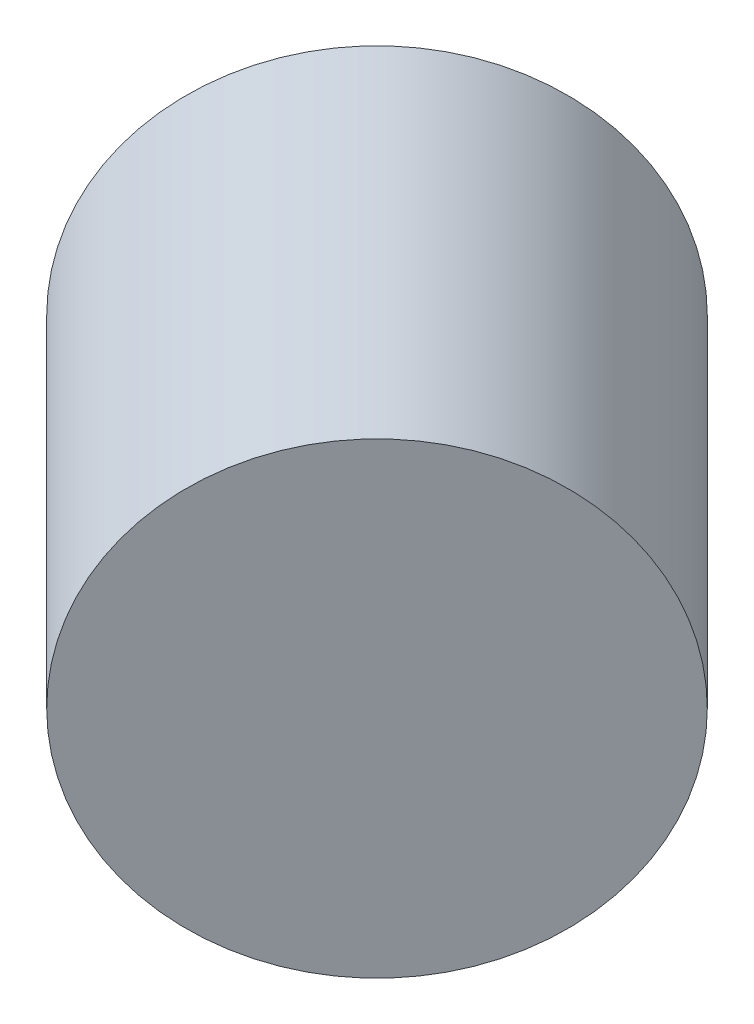
ISO-10303-21;
HEADER;
FILE_DESCRIPTION(('STEP AP214'),'2;1');
FILE_NAME('part.step','',(''),(''),'','','');
FILE_SCHEMA(('AUTOMOTIVE_DESIGN { 1 0 10303 214 1 1 1 1 }'));
ENDSEC;
DATA;
#1=APPLICATION_CONTEXT('core data for automotive mechanical design processes');
#2=APPLICATION_PROTOCOL_DEFINITION('international standard','automotive_design',2000,#1);
#3=PRODUCT_CONTEXT('',#1,'mechanical');
#4=PRODUCT('Part','Part','',(#3));
#5=PRODUCT_RELATED_PRODUCT_CATEGORY('part','',(#4));
#6=PRODUCT_DEFINITION_FORMATION('','',#4);
#7=PRODUCT_DEFINITION_CONTEXT('part definition',#1,'design');
#8=PRODUCT_DEFINITION('design','',#6,#7);
#9=PRODUCT_DEFINITION_SHAPE('','',#8);
#10=(LENGTH_UNIT() NAMED_UNIT(*) SI_UNIT(.MILLI.,.METRE.));
#11=(NAMED_UNIT(*) PLANE_ANGLE_UNIT() SI_UNIT($,.RADIAN.));
#12=(NAMED_UNIT(*) SI_UNIT($,.STERADIAN.) SOLID_ANGLE_UNIT());
#13=UNCERTAINTY_MEASURE_WITH_UNIT(LENGTH_MEASURE(1.E-05),#10,'distance_accuracy_value','');
#14=(GEOMETRIC_REPRESENTATION_CONTEXT(3) GLOBAL_UNCERTAINTY_ASSIGNED_CONTEXT((#13)) GLOBAL_UNIT_ASSIGNED_CONTEXT((#10,
#11,#12)) REPRESENTATION_CONTEXT('',''));
#15=CARTESIAN_POINT('',(0.,0.,0.));
#16=DIRECTION('',(0.,0.,1.));
#17=DIRECTION('',(1.,0.,0.));
#18=AXIS2_PLACEMENT_3D('',#15,#16,#17);
#19=CARTESIAN_POINT('',(310.487188391881,-7.50000000000009,-479.362328548101));
#20=DIRECTION('',(-0.707106781186552,0.,-0.707106781186543));
#21=DIRECTION('',(-0.707106781186543,0.,0.707106781186552));
#22=AXIS2_PLACEMENT_3D('',#19,#20,#21);
#23=CYLINDRICAL_SURFACE('',#22,49.0000000000003);
#24=CARTESIAN_POINT('',(310.487188391881,-7.50000000000009,-479.362328548101));
#25=DIRECTION('',(-0.707106781186552,0.,-0.707106781186543));
#26=DIRECTION('',(-0.707106781186543,0.,0.707106781186552));
#27=AXIS2_PLACEMENT_3D('',#24,#25,#26);
#28=CIRCLE('',#27,49.0000000000003);
#29=CARTESIAN_POINT('',(275.83895611374,-7.50000000000009,-444.71409626996));
#30=VERTEX_POINT('',#29);
#31=EDGE_CURVE('E10',#30,#30,#28,.T.);
#32=ORIENTED_EDGE('',*,*,#31,.T.);
#33=EDGE_LOOP('',(#32));
#34=FACE_BOUND('',#33,.T.);
#35=CARTESIAN_POINT('',(239.069403492039,-7.50000000000009,-550.780113447942));
#36=DIRECTION('',(-0.707106781186552,0.,-0.707106781186543));
#37=DIRECTION('',(-0.707106781186543,0.,0.707106781186552));
#38=AXIS2_PLACEMENT_3D('',#35,#36,#37);
#39=CIRCLE('',#38,49.0000000000003);
#40=CARTESIAN_POINT('',(204.421171213898,-7.50000000000009,-516.131881169801));
#41=VERTEX_POINT('',#40);
#42=EDGE_CURVE('E34',#41,#41,#39,.T.);
#43=ORIENTED_EDGE('',*,*,#42,.F.);
#44=EDGE_LOOP('',(#43));
#45=FACE_BOUND('',#44,.T.);
#46=ADVANCED_FACE('F31',(#34,#45),#23,.T.);
#47=CARTESIAN_POINT('',(310.487188391881,-7.50000000000009,-479.362328548101));
#48=DIRECTION('',(-0.707106781186552,0.,-0.707106781186543));
#49=DIRECTION('',(-0.707106781186543,0.,0.707106781186552));
#50=AXIS2_PLACEMENT_3D('',#47,#48,#49);
#51=PLANE('',#50);
#52=ORIENTED_EDGE('',*,*,#31,.F.);
#53=EDGE_LOOP('',(#52));
#54=FACE_BOUND('',#53,.T.);
#55=ADVANCED_FACE('F46',(#54),#51,.F.);
#56=CARTESIAN_POINT('',(239.069403492039,-7.50000000000009,-550.780113447942));
#57=DIRECTION('',(-0.707106781186552,0.,-0.707106781186543));
#58=DIRECTION('',(-0.707106781186543,0.,0.707106781186552));
#59=AXIS2_PLACEMENT_3D('',#56,#57,#58);
#60=PLANE('',#59);
#61=ORIENTED_EDGE('',*,*,#42,.T.);
#62=EDGE_LOOP('',(#61));
#63=FACE_BOUND('',#62,.T.);
#64=ADVANCED_FACE('F43',(#63),#60,.T.);
#65=CLOSED_SHELL('',(#46,#55,#64));
#66=MANIFOLD_SOLID_BREP('B2',#65);
#67=ADVANCED_BREP_SHAPE_REPRESENTATION('',(#18,#66),#14);
#68=SHAPE_DEFINITION_REPRESENTATION(#9,#67);
ENDSEC;
END-ISO-10303-21;
